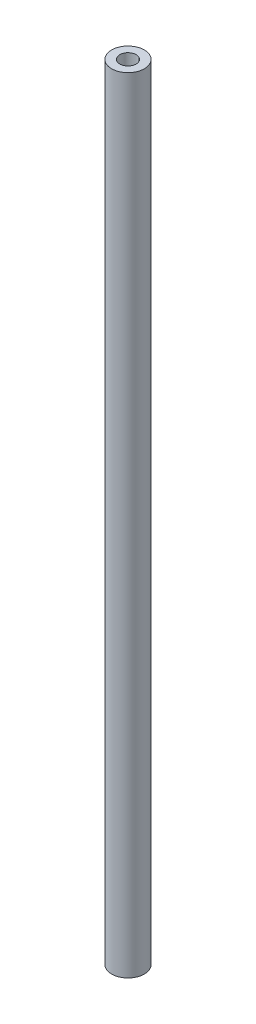
ISO-10303-21;
HEADER;
FILE_DESCRIPTION(('STEP AP214'),'2;1');
FILE_NAME('part.step','',(''),(''),'','','');
FILE_SCHEMA(('AUTOMOTIVE_DESIGN { 1 0 10303 214 1 1 1 1 }'));
ENDSEC;
DATA;
#1=APPLICATION_CONTEXT('core data for automotive mechanical design processes');
#2=APPLICATION_PROTOCOL_DEFINITION('international standard','automotive_design',2000,#1);
#3=PRODUCT_CONTEXT('',#1,'mechanical');
#4=PRODUCT('Part','Part','',(#3));
#5=PRODUCT_RELATED_PRODUCT_CATEGORY('part','',(#4));
#6=PRODUCT_DEFINITION_FORMATION('','',#4);
#7=PRODUCT_DEFINITION_CONTEXT('part definition',#1,'design');
#8=PRODUCT_DEFINITION('design','',#6,#7);
#9=PRODUCT_DEFINITION_SHAPE('','',#8);
#10=(LENGTH_UNIT() NAMED_UNIT(*) SI_UNIT(.MILLI.,.METRE.));
#11=(NAMED_UNIT(*) PLANE_ANGLE_UNIT() SI_UNIT($,.RADIAN.));
#12=(NAMED_UNIT(*) SI_UNIT($,.STERADIAN.) SOLID_ANGLE_UNIT());
#13=UNCERTAINTY_MEASURE_WITH_UNIT(LENGTH_MEASURE(1.E-05),#10,'distance_accuracy_value','');
#14=(GEOMETRIC_REPRESENTATION_CONTEXT(3) GLOBAL_UNCERTAINTY_ASSIGNED_CONTEXT((#13)) GLOBAL_UNIT_ASSIGNED_CONTEXT((#10,
#11,#12)) REPRESENTATION_CONTEXT('',''));
#15=CARTESIAN_POINT('',(0.,0.,0.));
#16=DIRECTION('',(0.,0.,1.));
#17=DIRECTION('',(1.,0.,0.));
#18=AXIS2_PLACEMENT_3D('',#15,#16,#17);
#19=CARTESIAN_POINT('',(0.,240.,0.));
#20=DIRECTION('',(0.,-1.,0.));
#21=DIRECTION('',(0.,0.,-1.));
#22=AXIS2_PLACEMENT_3D('',#19,#20,#21);
#23=CYLINDRICAL_SURFACE('',#22,5.);
#24=CARTESIAN_POINT('',(0.,240.,0.));
#25=DIRECTION('',(0.,1.,0.));
#26=DIRECTION('',(0.,0.,1.));
#27=AXIS2_PLACEMENT_3D('',#24,#25,#26);
#28=CIRCLE('',#27,5.);
#29=CARTESIAN_POINT('',(0.,240.,5.));
#30=VERTEX_POINT('',#29);
#31=EDGE_CURVE('E10',#30,#30,#28,.T.);
#32=ORIENTED_EDGE('',*,*,#31,.F.);
#33=EDGE_LOOP('',(#32));
#34=FACE_BOUND('',#33,.T.);
#35=CARTESIAN_POINT('',(0.,0.,0.));
#36=DIRECTION('',(0.,1.,0.));
#37=DIRECTION('',(0.,0.,1.));
#38=AXIS2_PLACEMENT_3D('',#35,#36,#37);
#39=CIRCLE('',#38,5.);
#40=CARTESIAN_POINT('',(0.,0.,5.));
#41=VERTEX_POINT('',#40);
#42=EDGE_CURVE('E35',#41,#41,#39,.T.);
#43=ORIENTED_EDGE('',*,*,#42,.T.);
#44=EDGE_LOOP('',(#43));
#45=FACE_BOUND('',#44,.T.);
#46=ADVANCED_FACE('F32',(#34,#45),#23,.T.);
#47=CARTESIAN_POINT('',(0.,240.,0.));
#48=DIRECTION('',(0.,1.,0.));
#49=DIRECTION('',(0.,0.,1.));
#50=AXIS2_PLACEMENT_3D('',#47,#48,#49);
#51=PLANE('',#50);
#52=CARTESIAN_POINT('',(0.,240.,0.));
#53=DIRECTION('',(0.,1.,0.));
#54=DIRECTION('',(0.,0.,1.));
#55=AXIS2_PLACEMENT_3D('',#52,#53,#54);
#56=CIRCLE('',#55,2.5);
#57=CARTESIAN_POINT('',(0.,240.,2.5));
#58=VERTEX_POINT('',#57);
#59=EDGE_CURVE('E44',#58,#58,#56,.T.);
#60=ORIENTED_EDGE('',*,*,#59,.F.);
#61=EDGE_LOOP('',(#60));
#62=FACE_BOUND('',#61,.T.);
#63=ORIENTED_EDGE('',*,*,#31,.T.);
#64=EDGE_LOOP('',(#63));
#65=FACE_BOUND('',#64,.T.);
#66=ADVANCED_FACE('F59',(#62,#65),#51,.T.);
#67=CARTESIAN_POINT('',(0.,0.,0.));
#68=DIRECTION('',(0.,1.,0.));
#69=DIRECTION('',(0.,0.,1.));
#70=AXIS2_PLACEMENT_3D('',#67,#68,#69);
#71=PLANE('',#70);
#72=ORIENTED_EDGE('',*,*,#42,.F.);
#73=EDGE_LOOP('',(#72));
#74=FACE_BOUND('',#73,.T.);
#75=ADVANCED_FACE('F55',(#74),#71,.F.);
#76=CARTESIAN_POINT('',(0.,210.,0.));
#77=DIRECTION('',(0.,1.,0.));
#78=DIRECTION('',(0.,0.,1.));
#79=AXIS2_PLACEMENT_3D('',#76,#77,#78);
#80=CYLINDRICAL_SURFACE('',#79,2.5);
#81=CARTESIAN_POINT('',(0.,210.,0.));
#82=DIRECTION('',(0.,1.,0.));
#83=DIRECTION('',(0.,0.,1.));
#84=AXIS2_PLACEMENT_3D('',#81,#82,#83);
#85=CIRCLE('',#84,2.5);
#86=CARTESIAN_POINT('',(0.,210.,2.5));
#87=VERTEX_POINT('',#86);
#88=EDGE_CURVE('E42',#87,#87,#85,.T.);
#89=ORIENTED_EDGE('',*,*,#88,.F.);
#90=EDGE_LOOP('',(#89));
#91=FACE_BOUND('',#90,.T.);
#92=ORIENTED_EDGE('',*,*,#59,.T.);
#93=EDGE_LOOP('',(#92));
#94=FACE_BOUND('',#93,.T.);
#95=ADVANCED_FACE('F52',(#91,#94),#80,.F.);
#96=CARTESIAN_POINT('',(0.,210.,0.));
#97=DIRECTION('',(0.,1.,0.));
#98=DIRECTION('',(0.,0.,1.));
#99=AXIS2_PLACEMENT_3D('',#96,#97,#98);
#100=PLANE('',#99);
#101=ORIENTED_EDGE('',*,*,#88,.T.);
#102=EDGE_LOOP('',(#101));
#103=FACE_BOUND('',#102,.T.);
#104=ADVANCED_FACE('F50',(#103),#100,.T.);
#105=CLOSED_SHELL('',(#46,#66,#75,#95,#104));
#106=MANIFOLD_SOLID_BREP('B2',#105);
#107=ADVANCED_BREP_SHAPE_REPRESENTATION('',(#18,#106),#14);
#108=SHAPE_DEFINITION_REPRESENTATION(#9,#107);
ENDSEC;
END-ISO-10303-21;
